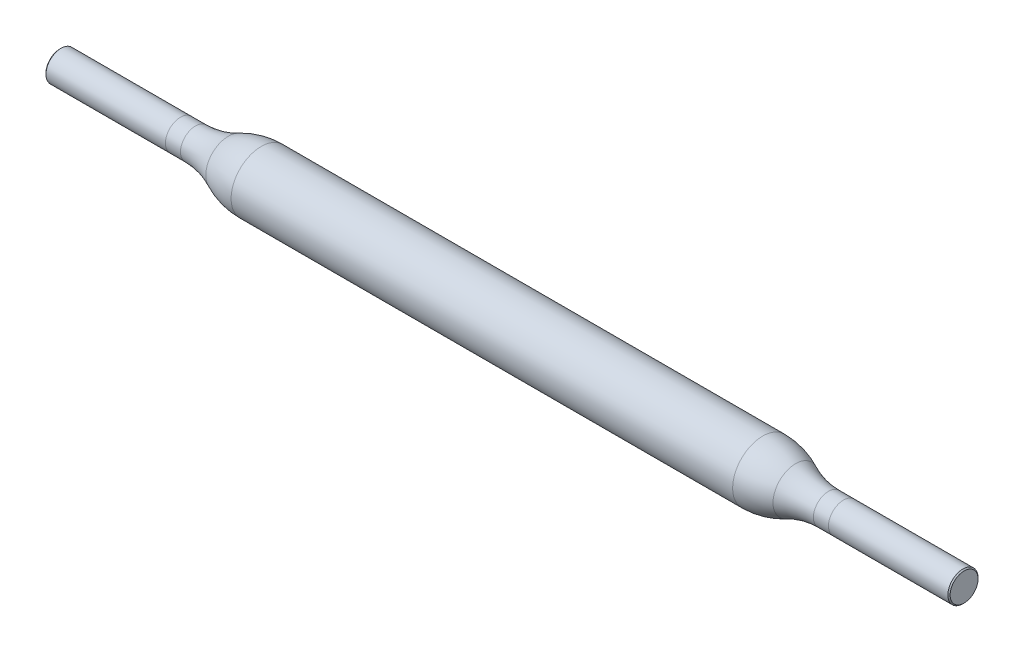
ISO-10303-21;
HEADER;
FILE_DESCRIPTION(('STEP AP214'),'2;1');
FILE_NAME('part.step','',(''),(''),'','','');
FILE_SCHEMA(('AUTOMOTIVE_DESIGN { 1 0 10303 214 1 1 1 1 }'));
ENDSEC;
DATA;
#1=APPLICATION_CONTEXT('core data for automotive mechanical design processes');
#2=APPLICATION_PROTOCOL_DEFINITION('international standard','automotive_design',2000,#1);
#3=PRODUCT_CONTEXT('',#1,'mechanical');
#4=PRODUCT('Part','Part','',(#3));
#5=PRODUCT_RELATED_PRODUCT_CATEGORY('part','',(#4));
#6=PRODUCT_DEFINITION_FORMATION('','',#4);
#7=PRODUCT_DEFINITION_CONTEXT('part definition',#1,'design');
#8=PRODUCT_DEFINITION('design','',#6,#7);
#9=PRODUCT_DEFINITION_SHAPE('','',#8);
#10=(LENGTH_UNIT() NAMED_UNIT(*) SI_UNIT(.MILLI.,.METRE.));
#11=(NAMED_UNIT(*) PLANE_ANGLE_UNIT() SI_UNIT($,.RADIAN.));
#12=(NAMED_UNIT(*) SI_UNIT($,.STERADIAN.) SOLID_ANGLE_UNIT());
#13=UNCERTAINTY_MEASURE_WITH_UNIT(LENGTH_MEASURE(1.E-05),#10,'distance_accuracy_value','');
#14=(GEOMETRIC_REPRESENTATION_CONTEXT(3) GLOBAL_UNCERTAINTY_ASSIGNED_CONTEXT((#13)) GLOBAL_UNIT_ASSIGNED_CONTEXT((#10,
#11,#12)) REPRESENTATION_CONTEXT('',''));
#15=CARTESIAN_POINT('',(0.,0.,0.));
#16=DIRECTION('',(0.,0.,1.));
#17=DIRECTION('',(1.,0.,0.));
#18=AXIS2_PLACEMENT_3D('',#15,#16,#17);
#19=CARTESIAN_POINT('',(-30.,0.,0.));
#20=DIRECTION('',(-1.,0.,0.));
#21=DIRECTION('',(0.,0.,1.));
#22=AXIS2_PLACEMENT_3D('',#19,#20,#21);
#23=CYLINDRICAL_SURFACE('',#22,0.999999999999999);
#24=CARTESIAN_POINT('',(21.,0.,0.));
#25=DIRECTION('',(-1.,0.,0.));
#26=DIRECTION('',(0.,0.,1.));
#27=AXIS2_PLACEMENT_3D('',#24,#25,#26);
#28=CIRCLE('',#27,0.999999999999999);
#29=CARTESIAN_POINT('',(21.,0.,0.999999999999999));
#30=VERTEX_POINT('',#29);
#31=EDGE_CURVE('E69',#30,#30,#28,.T.);
#32=ORIENTED_EDGE('',*,*,#31,.F.);
#33=EDGE_LOOP('',(#32));
#34=FACE_BOUND('',#33,.T.);
#35=CARTESIAN_POINT('',(22.,0.,0.));
#36=DIRECTION('',(1.,0.,0.));
#37=DIRECTION('',(0.,0.,-1.));
#38=AXIS2_PLACEMENT_3D('',#35,#36,#37);
#39=CIRCLE('',#38,0.999999999999999);
#40=CARTESIAN_POINT('',(22.,0.,-0.999999999999999));
#41=VERTEX_POINT('',#40);
#42=EDGE_CURVE('E61',#41,#41,#39,.T.);
#43=ORIENTED_EDGE('',*,*,#42,.F.);
#44=EDGE_LOOP('',(#43));
#45=FACE_BOUND('',#44,.T.);
#46=ADVANCED_FACE('F41',(#34,#45),#23,.T.);
#47=CARTESIAN_POINT('',(-30.,0.,0.));
#48=DIRECTION('',(-1.,0.,0.));
#49=DIRECTION('',(0.,0.,1.));
#50=AXIS2_PLACEMENT_3D('',#47,#48,#49);
#51=CYLINDRICAL_SURFACE('',#50,1.);
#52=CARTESIAN_POINT('',(-29.925,0.,0.));
#53=DIRECTION('',(1.,0.,0.));
#54=DIRECTION('',(0.,0.,-1.));
#55=AXIS2_PLACEMENT_3D('',#52,#53,#54);
#56=CIRCLE('',#55,1.);
#57=CARTESIAN_POINT('',(-29.925,0.,-1.));
#58=VERTEX_POINT('',#57);
#59=EDGE_CURVE('E52',#58,#58,#56,.T.);
#60=ORIENTED_EDGE('',*,*,#59,.T.);
#61=EDGE_LOOP('',(#60));
#62=FACE_BOUND('',#61,.T.);
#63=CARTESIAN_POINT('',(-22.,0.,0.));
#64=DIRECTION('',(1.,0.,0.));
#65=DIRECTION('',(0.,0.,-1.));
#66=AXIS2_PLACEMENT_3D('',#63,#64,#65);
#67=CIRCLE('',#66,1.);
#68=CARTESIAN_POINT('',(-22.,0.,-1.));
#69=VERTEX_POINT('',#68);
#70=EDGE_CURVE('E65',#69,#69,#67,.T.);
#71=ORIENTED_EDGE('',*,*,#70,.F.);
#72=EDGE_LOOP('',(#71));
#73=FACE_BOUND('',#72,.T.);
#74=ADVANCED_FACE('F124',(#62,#73),#51,.T.);
#75=ORIENTED_EDGE('',*,*,#70,.T.);
#76=EDGE_LOOP('',(#75));
#77=FACE_BOUND('',#76,.T.);
#78=CARTESIAN_POINT('',(-21.,0.,0.));
#79=DIRECTION('',(-1.,0.,0.));
#80=DIRECTION('',(0.,0.,1.));
#81=AXIS2_PLACEMENT_3D('',#78,#79,#80);
#82=CIRCLE('',#81,1.);
#83=CARTESIAN_POINT('',(-21.,0.,1.));
#84=VERTEX_POINT('',#83);
#85=EDGE_CURVE('E84',#84,#84,#82,.T.);
#86=ORIENTED_EDGE('',*,*,#85,.T.);
#87=EDGE_LOOP('',(#86));
#88=FACE_BOUND('',#87,.T.);
#89=ADVANCED_FACE('F88',(#77,#88),#51,.T.);
#90=CARTESIAN_POINT('',(-30.,0.,0.));
#91=DIRECTION('',(1.,0.,0.));
#92=DIRECTION('',(0.,0.,-1.));
#93=AXIS2_PLACEMENT_3D('',#90,#91,#92);
#94=PLANE('',#93);
#95=CARTESIAN_POINT('',(-30.,0.,0.));
#96=DIRECTION('',(1.,0.,0.));
#97=DIRECTION('',(0.,0.,-1.));
#98=AXIS2_PLACEMENT_3D('',#95,#96,#97);
#99=CIRCLE('',#98,0.924999999999995);
#100=CARTESIAN_POINT('',(-30.,0.,-0.924999999999995));
#101=VERTEX_POINT('',#100);
#102=EDGE_CURVE('E56',#101,#101,#99,.F.);
#103=ORIENTED_EDGE('',*,*,#102,.T.);
#104=EDGE_LOOP('',(#103));
#105=FACE_BOUND('',#104,.T.);
#106=ADVANCED_FACE('F133',(#105),#94,.F.);
#107=CARTESIAN_POINT('',(30.,0.,0.));
#108=DIRECTION('',(-1.,0.,0.));
#109=DIRECTION('',(0.,0.,1.));
#110=AXIS2_PLACEMENT_3D('',#107,#108,#109);
#111=PLANE('',#110);
#112=CARTESIAN_POINT('',(30.,0.,0.));
#113=DIRECTION('',(-1.,0.,0.));
#114=DIRECTION('',(0.,0.,1.));
#115=AXIS2_PLACEMENT_3D('',#112,#113,#114);
#116=CIRCLE('',#115,0.925000000000002);
#117=CARTESIAN_POINT('',(30.,0.,0.925000000000002));
#118=VERTEX_POINT('',#117);
#119=EDGE_CURVE('E10',#118,#118,#116,.F.);
#120=ORIENTED_EDGE('',*,*,#119,.T.);
#121=EDGE_LOOP('',(#120));
#122=FACE_BOUND('',#121,.T.);
#123=ADVANCED_FACE('F129',(#122),#111,.F.);
#124=CARTESIAN_POINT('',(29.925,0.,0.));
#125=DIRECTION('',(-1.,0.,0.));
#126=DIRECTION('',(0.,0.,1.));
#127=AXIS2_PLACEMENT_3D('',#124,#125,#126);
#128=CIRCLE('',#127,0.999999999999999);
#129=CARTESIAN_POINT('',(29.925,0.,0.999999999999999));
#130=VERTEX_POINT('',#129);
#131=EDGE_CURVE('E48',#130,#130,#128,.T.);
#132=ORIENTED_EDGE('',*,*,#131,.T.);
#133=EDGE_LOOP('',(#132));
#134=FACE_BOUND('',#133,.T.);
#135=ORIENTED_EDGE('',*,*,#42,.T.);
#136=EDGE_LOOP('',(#135));
#137=FACE_BOUND('',#136,.T.);
#138=ADVANCED_FACE('F118',(#134,#137),#23,.T.);
#139=CARTESIAN_POINT('',(21.,0.,0.));
#140=DIRECTION('',(-1.,0.,0.));
#141=DIRECTION('',(0.,0.,1.));
#142=AXIS2_PLACEMENT_3D('',#139,#140,#141);
#143=TOROIDAL_SURFACE('',#142,6.,5.);
#144=CARTESIAN_POINT('',(18.8205505282297,0.,0.));
#145=DIRECTION('',(-1.,0.,0.));
#146=DIRECTION('',(0.,0.,1.));
#147=AXIS2_PLACEMENT_3D('',#144,#145,#146);
#148=CIRCLE('',#147,1.5);
#149=CARTESIAN_POINT('',(18.8205505282297,0.,1.5));
#150=VERTEX_POINT('',#149);
#151=EDGE_CURVE('E72',#150,#150,#148,.T.);
#152=ORIENTED_EDGE('',*,*,#151,.F.);
#153=EDGE_LOOP('',(#152));
#154=FACE_BOUND('',#153,.T.);
#155=ORIENTED_EDGE('',*,*,#31,.T.);
#156=EDGE_LOOP('',(#155));
#157=FACE_BOUND('',#156,.T.);
#158=ADVANCED_FACE('F112',(#154,#157),#143,.F.);
#159=CARTESIAN_POINT('',(16.6411010564593,0.,0.));
#160=DIRECTION('',(-1.,0.,0.));
#161=DIRECTION('',(0.,0.,1.));
#162=AXIS2_PLACEMENT_3D('',#159,#160,#161);
#163=DEGENERATE_TOROIDAL_SURFACE('',#162,3.,5.,.F.);
#164=CARTESIAN_POINT('',(16.6411010564593,0.,0.));
#165=DIRECTION('',(-1.,0.,0.));
#166=DIRECTION('',(0.,0.,1.));
#167=AXIS2_PLACEMENT_3D('',#164,#165,#166);
#168=CIRCLE('',#167,2.);
#169=CARTESIAN_POINT('',(16.6411010564593,0.,2.));
#170=VERTEX_POINT('',#169);
#171=EDGE_CURVE('E75',#170,#170,#168,.T.);
#172=ORIENTED_EDGE('',*,*,#171,.F.);
#173=EDGE_LOOP('',(#172));
#174=FACE_BOUND('',#173,.T.);
#175=ORIENTED_EDGE('',*,*,#151,.T.);
#176=EDGE_LOOP('',(#175));
#177=FACE_BOUND('',#176,.T.);
#178=ADVANCED_FACE('F106',(#174,#177),#163,.F.);
#179=CARTESIAN_POINT('',(-30.,0.,0.));
#180=DIRECTION('',(-1.,0.,0.));
#181=DIRECTION('',(0.,0.,1.));
#182=AXIS2_PLACEMENT_3D('',#179,#180,#181);
#183=CYLINDRICAL_SURFACE('',#182,2.);
#184=CARTESIAN_POINT('',(-16.6411010564593,0.,0.));
#185=DIRECTION('',(-1.,0.,0.));
#186=DIRECTION('',(0.,0.,1.));
#187=AXIS2_PLACEMENT_3D('',#184,#185,#186);
#188=CIRCLE('',#187,2.);
#189=CARTESIAN_POINT('',(-16.6411010564593,0.,2.));
#190=VERTEX_POINT('',#189);
#191=EDGE_CURVE('E78',#190,#190,#188,.T.);
#192=ORIENTED_EDGE('',*,*,#191,.F.);
#193=EDGE_LOOP('',(#192));
#194=FACE_BOUND('',#193,.T.);
#195=ORIENTED_EDGE('',*,*,#171,.T.);
#196=EDGE_LOOP('',(#195));
#197=FACE_BOUND('',#196,.T.);
#198=ADVANCED_FACE('F100',(#194,#197),#183,.T.);
#199=CARTESIAN_POINT('',(-16.6411010564593,0.,0.));
#200=DIRECTION('',(-1.,0.,0.));
#201=DIRECTION('',(0.,0.,1.));
#202=AXIS2_PLACEMENT_3D('',#199,#200,#201);
#203=DEGENERATE_TOROIDAL_SURFACE('',#202,3.,5.,.F.);
#204=CARTESIAN_POINT('',(-18.8205505282297,0.,0.));
#205=DIRECTION('',(-1.,0.,0.));
#206=DIRECTION('',(0.,0.,1.));
#207=AXIS2_PLACEMENT_3D('',#204,#205,#206);
#208=CIRCLE('',#207,1.5);
#209=CARTESIAN_POINT('',(-18.8205505282297,0.,1.5));
#210=VERTEX_POINT('',#209);
#211=EDGE_CURVE('E81',#210,#210,#208,.T.);
#212=ORIENTED_EDGE('',*,*,#211,.F.);
#213=EDGE_LOOP('',(#212));
#214=FACE_BOUND('',#213,.T.);
#215=ORIENTED_EDGE('',*,*,#191,.T.);
#216=EDGE_LOOP('',(#215));
#217=FACE_BOUND('',#216,.T.);
#218=ADVANCED_FACE('F94',(#214,#217),#203,.F.);
#219=CARTESIAN_POINT('',(-21.,0.,0.));
#220=DIRECTION('',(-1.,0.,0.));
#221=DIRECTION('',(0.,0.,1.));
#222=AXIS2_PLACEMENT_3D('',#219,#220,#221);
#223=TOROIDAL_SURFACE('',#222,6.,5.);
#224=ORIENTED_EDGE('',*,*,#85,.F.);
#225=EDGE_LOOP('',(#224));
#226=FACE_BOUND('',#225,.T.);
#227=ORIENTED_EDGE('',*,*,#211,.T.);
#228=EDGE_LOOP('',(#227));
#229=FACE_BOUND('',#228,.T.);
#230=ADVANCED_FACE('F90',(#226,#229),#223,.F.);
#231=CARTESIAN_POINT('',(-30.,0.,0.));
#232=DIRECTION('',(1.,0.,0.));
#233=DIRECTION('',(0.,0.,-1.));
#234=AXIS2_PLACEMENT_3D('',#231,#232,#233);
#235=CONICAL_SURFACE('',#234,0.924999999999995,0.785398163397489);
#236=ORIENTED_EDGE('',*,*,#59,.F.);
#237=EDGE_LOOP('',(#236));
#238=FACE_BOUND('',#237,.T.);
#239=ORIENTED_EDGE('',*,*,#102,.F.);
#240=EDGE_LOOP('',(#239));
#241=FACE_BOUND('',#240,.T.);
#242=ADVANCED_FACE('F93',(#238,#241),#235,.T.);
#243=CARTESIAN_POINT('',(29.925,0.,0.));
#244=DIRECTION('',(-1.,0.,0.));
#245=DIRECTION('',(0.,0.,1.));
#246=AXIS2_PLACEMENT_3D('',#243,#244,#245);
#247=CONICAL_SURFACE('',#246,0.999999999999999,0.785398163397483);
#248=ORIENTED_EDGE('',*,*,#119,.F.);
#249=EDGE_LOOP('',(#248));
#250=FACE_BOUND('',#249,.T.);
#251=ORIENTED_EDGE('',*,*,#131,.F.);
#252=EDGE_LOOP('',(#251));
#253=FACE_BOUND('',#252,.T.);
#254=ADVANCED_FACE('F43',(#250,#253),#247,.T.);
#255=CLOSED_SHELL('',(#46,#74,#89,#106,#123,#138,#158,#178,#198,#218,#230,#242,#254));
#256=MANIFOLD_SOLID_BREP('B2',#255);
#257=ADVANCED_BREP_SHAPE_REPRESENTATION('',(#18,#256),#14);
#258=SHAPE_DEFINITION_REPRESENTATION(#9,#257);
ENDSEC;
END-ISO-10303-21;
